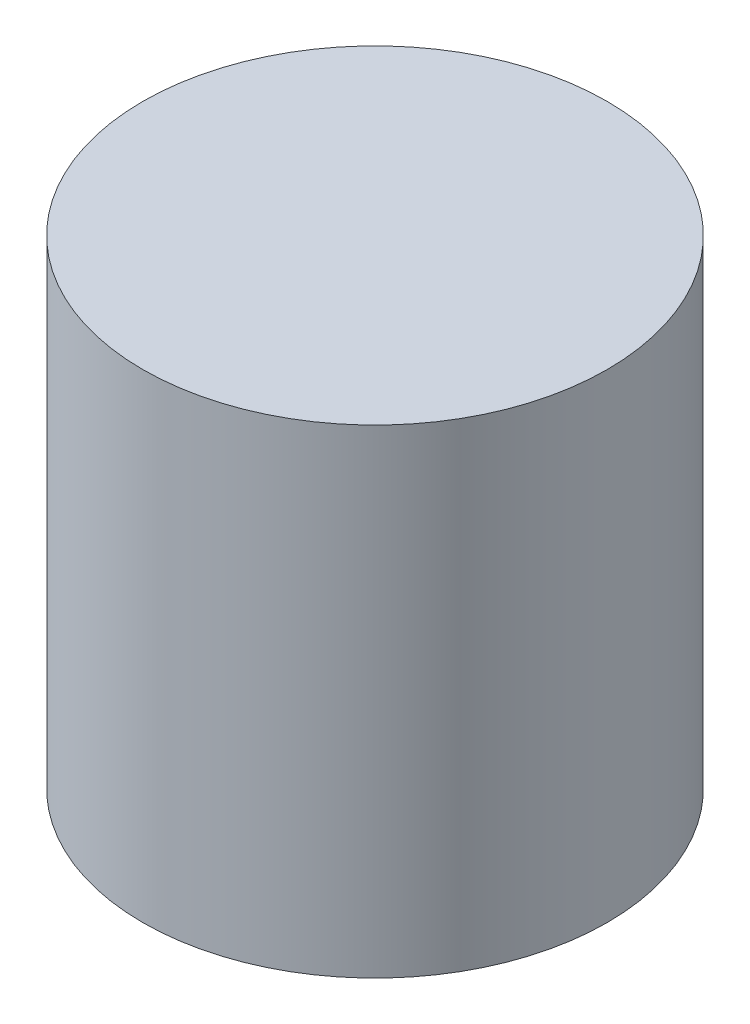
ISO-10303-21;
HEADER;
FILE_DESCRIPTION(('STEP AP214'),'2;1');
FILE_NAME('part.step','',(''),(''),'','','');
FILE_SCHEMA(('AUTOMOTIVE_DESIGN { 1 0 10303 214 1 1 1 1 }'));
ENDSEC;
DATA;
#1=APPLICATION_CONTEXT('core data for automotive mechanical design processes');
#2=APPLICATION_PROTOCOL_DEFINITION('international standard','automotive_design',2000,#1);
#3=PRODUCT_CONTEXT('',#1,'mechanical');
#4=PRODUCT('Part','Part','',(#3));
#5=PRODUCT_RELATED_PRODUCT_CATEGORY('part','',(#4));
#6=PRODUCT_DEFINITION_FORMATION('','',#4);
#7=PRODUCT_DEFINITION_CONTEXT('part definition',#1,'design');
#8=PRODUCT_DEFINITION('design','',#6,#7);
#9=PRODUCT_DEFINITION_SHAPE('','',#8);
#10=(LENGTH_UNIT() NAMED_UNIT(*) SI_UNIT(.MILLI.,.METRE.));
#11=(NAMED_UNIT(*) PLANE_ANGLE_UNIT() SI_UNIT($,.RADIAN.));
#12=(NAMED_UNIT(*) SI_UNIT($,.STERADIAN.) SOLID_ANGLE_UNIT());
#13=UNCERTAINTY_MEASURE_WITH_UNIT(LENGTH_MEASURE(1.E-05),#10,'distance_accuracy_value','');
#14=(GEOMETRIC_REPRESENTATION_CONTEXT(3) GLOBAL_UNCERTAINTY_ASSIGNED_CONTEXT((#13)) GLOBAL_UNIT_ASSIGNED_CONTEXT((#10,
#11,#12)) REPRESENTATION_CONTEXT('',''));
#15=CARTESIAN_POINT('',(0.,0.,0.));
#16=DIRECTION('',(0.,0.,1.));
#17=DIRECTION('',(1.,0.,0.));
#18=AXIS2_PLACEMENT_3D('',#15,#16,#17);
#19=CARTESIAN_POINT('',(0.,16.5,0.));
#20=DIRECTION('',(0.,-1.,0.));
#21=DIRECTION('',(0.,0.,-1.));
#22=AXIS2_PLACEMENT_3D('',#19,#20,#21);
#23=CYLINDRICAL_SURFACE('',#22,8.);
#24=CARTESIAN_POINT('',(0.,16.5,0.));
#25=DIRECTION('',(0.,1.,0.));
#26=DIRECTION('',(0.,0.,1.));
#27=AXIS2_PLACEMENT_3D('',#24,#25,#26);
#28=CIRCLE('',#27,8.);
#29=CARTESIAN_POINT('',(0.,16.5,8.));
#30=VERTEX_POINT('',#29);
#31=EDGE_CURVE('E10',#30,#30,#28,.T.);
#32=ORIENTED_EDGE('',*,*,#31,.F.);
#33=EDGE_LOOP('',(#32));
#34=FACE_BOUND('',#33,.T.);
#35=CARTESIAN_POINT('',(0.,0.,0.));
#36=DIRECTION('',(0.,1.,0.));
#37=DIRECTION('',(0.,0.,1.));
#38=AXIS2_PLACEMENT_3D('',#35,#36,#37);
#39=CIRCLE('',#38,8.);
#40=CARTESIAN_POINT('',(0.,0.,8.));
#41=VERTEX_POINT('',#40);
#42=EDGE_CURVE('E36',#41,#41,#39,.T.);
#43=ORIENTED_EDGE('',*,*,#42,.T.);
#44=EDGE_LOOP('',(#43));
#45=FACE_BOUND('',#44,.T.);
#46=ADVANCED_FACE('F33',(#34,#45),#23,.T.);
#47=CARTESIAN_POINT('',(0.,16.5,0.));
#48=DIRECTION('',(0.,1.,0.));
#49=DIRECTION('',(0.,0.,1.));
#50=AXIS2_PLACEMENT_3D('',#47,#48,#49);
#51=PLANE('',#50);
#52=ORIENTED_EDGE('',*,*,#31,.T.);
#53=EDGE_LOOP('',(#52));
#54=FACE_BOUND('',#53,.T.);
#55=ADVANCED_FACE('F48',(#54),#51,.T.);
#56=CARTESIAN_POINT('',(0.,0.,0.));
#57=DIRECTION('',(0.,1.,0.));
#58=DIRECTION('',(0.,0.,1.));
#59=AXIS2_PLACEMENT_3D('',#56,#57,#58);
#60=PLANE('',#59);
#61=ORIENTED_EDGE('',*,*,#42,.F.);
#62=EDGE_LOOP('',(#61));
#63=FACE_BOUND('',#62,.T.);
#64=ADVANCED_FACE('F46',(#63),#60,.F.);
#65=CLOSED_SHELL('',(#46,#55,#64));
#66=MANIFOLD_SOLID_BREP('B2',#65);
#67=ADVANCED_BREP_SHAPE_REPRESENTATION('',(#18,#66),#14);
#68=SHAPE_DEFINITION_REPRESENTATION(#9,#67);
ENDSEC;
END-ISO-10303-21;
